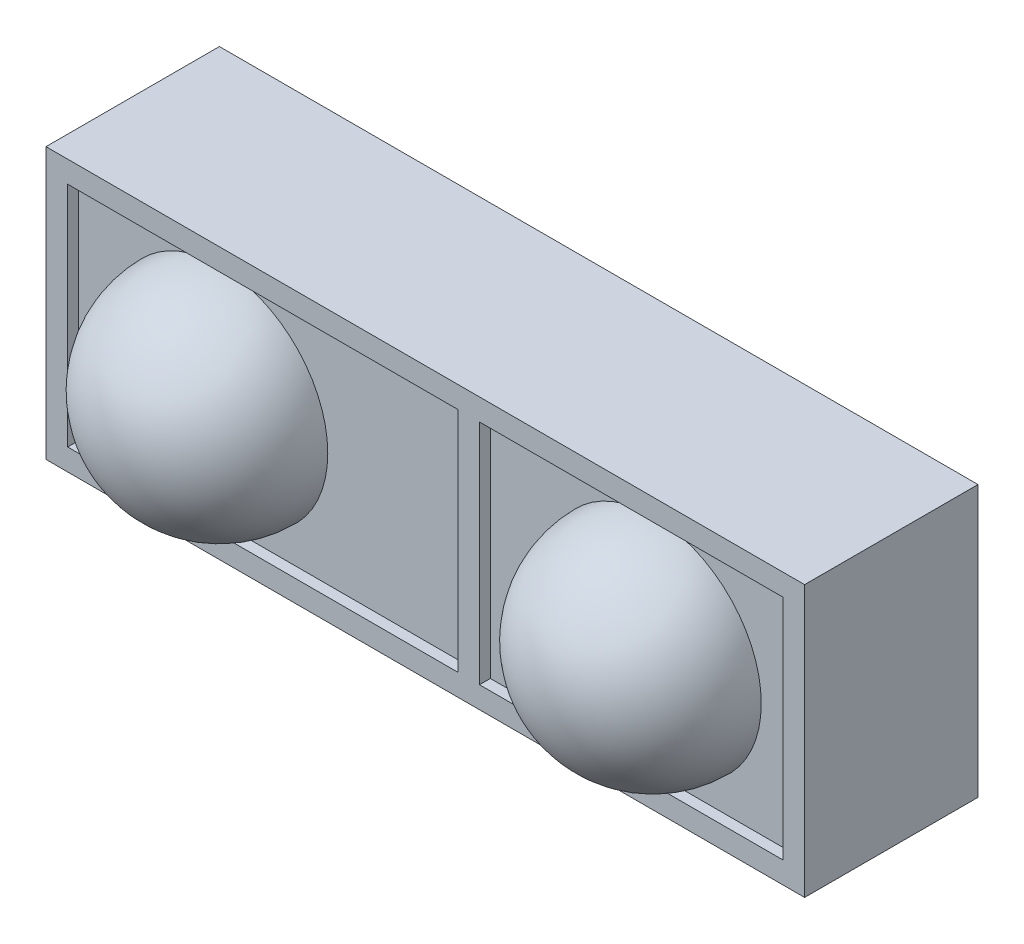
ISO-10303-21;
HEADER;
FILE_DESCRIPTION(('STEP AP214'),'2;1');
FILE_NAME('part.step','',(''),(''),'','','');
FILE_SCHEMA(('AUTOMOTIVE_DESIGN { 1 0 10303 214 1 1 1 1 }'));
ENDSEC;
DATA;
#1=APPLICATION_CONTEXT('core data for automotive mechanical design processes');
#2=APPLICATION_PROTOCOL_DEFINITION('international standard','automotive_design',2000,#1);
#3=PRODUCT_CONTEXT('',#1,'mechanical');
#4=PRODUCT('Part','Part','',(#3));
#5=PRODUCT_RELATED_PRODUCT_CATEGORY('part','',(#4));
#6=PRODUCT_DEFINITION_FORMATION('','',#4);
#7=PRODUCT_DEFINITION_CONTEXT('part definition',#1,'design');
#8=PRODUCT_DEFINITION('design','',#6,#7);
#9=PRODUCT_DEFINITION_SHAPE('','',#8);
#10=(LENGTH_UNIT() NAMED_UNIT(*) SI_UNIT(.MILLI.,.METRE.));
#11=(NAMED_UNIT(*) PLANE_ANGLE_UNIT() SI_UNIT($,.RADIAN.));
#12=(NAMED_UNIT(*) SI_UNIT($,.STERADIAN.) SOLID_ANGLE_UNIT());
#13=UNCERTAINTY_MEASURE_WITH_UNIT(LENGTH_MEASURE(1.E-05),#10,'distance_accuracy_value','');
#14=(GEOMETRIC_REPRESENTATION_CONTEXT(3) GLOBAL_UNCERTAINTY_ASSIGNED_CONTEXT((#13)) GLOBAL_UNIT_ASSIGNED_CONTEXT((#10,
#11,#12)) REPRESENTATION_CONTEXT('',''));
#15=CARTESIAN_POINT('',(0.,0.,0.));
#16=DIRECTION('',(0.,0.,1.));
#17=DIRECTION('',(1.,0.,0.));
#18=AXIS2_PLACEMENT_3D('',#15,#16,#17);
#19=CARTESIAN_POINT('',(-3.5,1.25,1.5));
#20=DIRECTION('',(1.,0.,0.));
#21=DIRECTION('',(0.,0.,-1.));
#22=AXIS2_PLACEMENT_3D('',#19,#20,#21);
#23=PLANE('',#22);
#24=DIRECTION('',(0.,-1.,0.));
#25=VECTOR('',#24,1.);
#26=CARTESIAN_POINT('',(-3.5,1.25,0.));
#27=LINE('',#26,#25);
#28=CARTESIAN_POINT('',(-3.5,1.25,0.));
#29=VERTEX_POINT('',#28);
#30=CARTESIAN_POINT('',(-3.5,-1.25,0.));
#31=VERTEX_POINT('',#30);
#32=EDGE_CURVE('E197',#29,#31,#27,.T.);
#33=ORIENTED_EDGE('',*,*,#32,.T.);
#34=DIRECTION('',(0.,0.,-1.));
#35=VECTOR('',#34,1.);
#36=CARTESIAN_POINT('',(-3.5,-1.25,1.5));
#37=LINE('',#36,#35);
#38=CARTESIAN_POINT('',(-3.5,-1.25,1.6));
#39=VERTEX_POINT('',#38);
#40=EDGE_CURVE('E215',#39,#31,#37,.T.);
#41=ORIENTED_EDGE('',*,*,#40,.F.);
#42=DIRECTION('',(0.,-1.,0.));
#43=VECTOR('',#42,1.);
#44=CARTESIAN_POINT('',(-3.5,1.25,1.6));
#45=LINE('',#44,#43);
#46=CARTESIAN_POINT('',(-3.5,1.25,1.6));
#47=VERTEX_POINT('',#46);
#48=EDGE_CURVE('E188',#47,#39,#45,.T.);
#49=ORIENTED_EDGE('',*,*,#48,.F.);
#50=DIRECTION('',(0.,0.,-1.));
#51=VECTOR('',#50,1.);
#52=CARTESIAN_POINT('',(-3.5,1.25,1.5));
#53=LINE('',#52,#51);
#54=EDGE_CURVE('E206',#47,#29,#53,.T.);
#55=ORIENTED_EDGE('',*,*,#54,.T.);
#56=EDGE_LOOP('',(#33,#41,#49,#55));
#57=FACE_BOUND('',#56,.T.);
#58=ADVANCED_FACE('F31',(#57),#23,.F.);
#59=CARTESIAN_POINT('',(-3.5,-1.25,1.5));
#60=DIRECTION('',(0.,1.,0.));
#61=DIRECTION('',(0.,0.,1.));
#62=AXIS2_PLACEMENT_3D('',#59,#60,#61);
#63=PLANE('',#62);
#64=DIRECTION('',(1.,0.,0.));
#65=VECTOR('',#64,1.);
#66=CARTESIAN_POINT('',(-3.5,-1.25,0.));
#67=LINE('',#66,#65);
#68=CARTESIAN_POINT('',(3.5,-1.25,0.));
#69=VERTEX_POINT('',#68);
#70=EDGE_CURVE('E200',#31,#69,#67,.T.);
#71=ORIENTED_EDGE('',*,*,#70,.T.);
#72=DIRECTION('',(0.,0.,-1.));
#73=VECTOR('',#72,1.);
#74=CARTESIAN_POINT('',(3.5,-1.25,1.5));
#75=LINE('',#74,#73);
#76=CARTESIAN_POINT('',(3.5,-1.25,1.6));
#77=VERTEX_POINT('',#76);
#78=EDGE_CURVE('E212',#77,#69,#75,.T.);
#79=ORIENTED_EDGE('',*,*,#78,.F.);
#80=DIRECTION('',(1.,0.,0.));
#81=VECTOR('',#80,1.);
#82=CARTESIAN_POINT('',(-3.5,-1.25,1.6));
#83=LINE('',#82,#81);
#84=EDGE_CURVE('E191',#39,#77,#83,.T.);
#85=ORIENTED_EDGE('',*,*,#84,.F.);
#86=ORIENTED_EDGE('',*,*,#40,.T.);
#87=EDGE_LOOP('',(#71,#79,#85,#86));
#88=FACE_BOUND('',#87,.T.);
#89=ADVANCED_FACE('F239',(#88),#63,.F.);
#90=CARTESIAN_POINT('',(3.5,1.25,1.5));
#91=DIRECTION('',(-1.,0.,0.));
#92=DIRECTION('',(0.,-1.,0.));
#93=AXIS2_PLACEMENT_3D('',#90,#91,#92);
#94=PLANE('',#93);
#95=DIRECTION('',(0.,1.,0.));
#96=VECTOR('',#95,1.);
#97=CARTESIAN_POINT('',(3.5,1.25,0.));
#98=LINE('',#97,#96);
#99=CARTESIAN_POINT('',(3.5,1.25,0.));
#100=VERTEX_POINT('',#99);
#101=EDGE_CURVE('E202',#69,#100,#98,.T.);
#102=ORIENTED_EDGE('',*,*,#101,.T.);
#103=DIRECTION('',(0.,0.,-1.));
#104=VECTOR('',#103,1.);
#105=CARTESIAN_POINT('',(3.5,1.25,1.5));
#106=LINE('',#105,#104);
#107=CARTESIAN_POINT('',(3.5,1.25,1.6));
#108=VERTEX_POINT('',#107);
#109=EDGE_CURVE('E209',#108,#100,#106,.T.);
#110=ORIENTED_EDGE('',*,*,#109,.F.);
#111=DIRECTION('',(0.,1.,0.));
#112=VECTOR('',#111,1.);
#113=CARTESIAN_POINT('',(3.5,-1.25,1.6));
#114=LINE('',#113,#112);
#115=EDGE_CURVE('E194',#77,#108,#114,.T.);
#116=ORIENTED_EDGE('',*,*,#115,.F.);
#117=ORIENTED_EDGE('',*,*,#78,.T.);
#118=EDGE_LOOP('',(#102,#110,#116,#117));
#119=FACE_BOUND('',#118,.T.);
#120=ADVANCED_FACE('F244',(#119),#94,.F.);
#121=CARTESIAN_POINT('',(-3.5,1.25,1.5));
#122=DIRECTION('',(0.,-1.,0.));
#123=DIRECTION('',(0.,0.,-1.));
#124=AXIS2_PLACEMENT_3D('',#121,#122,#123);
#125=PLANE('',#124);
#126=DIRECTION('',(-1.,0.,0.));
#127=VECTOR('',#126,1.);
#128=CARTESIAN_POINT('',(-3.5,1.25,0.));
#129=LINE('',#128,#127);
#130=EDGE_CURVE('E204',#100,#29,#129,.T.);
#131=ORIENTED_EDGE('',*,*,#130,.T.);
#132=ORIENTED_EDGE('',*,*,#54,.F.);
#133=DIRECTION('',(-1.,0.,0.));
#134=VECTOR('',#133,1.);
#135=CARTESIAN_POINT('',(3.5,1.25,1.6));
#136=LINE('',#135,#134);
#137=EDGE_CURVE('E185',#108,#47,#136,.T.);
#138=ORIENTED_EDGE('',*,*,#137,.F.);
#139=ORIENTED_EDGE('',*,*,#109,.T.);
#140=EDGE_LOOP('',(#131,#132,#138,#139));
#141=FACE_BOUND('',#140,.T.);
#142=ADVANCED_FACE('F258',(#141),#125,.F.);
#143=CARTESIAN_POINT('',(-3.5,-1.25,0.));
#144=DIRECTION('',(0.,0.,1.));
#145=DIRECTION('',(1.,0.,0.));
#146=AXIS2_PLACEMENT_3D('',#143,#144,#145);
#147=PLANE('',#146);
#148=ORIENTED_EDGE('',*,*,#32,.F.);
#149=ORIENTED_EDGE('',*,*,#130,.F.);
#150=ORIENTED_EDGE('',*,*,#101,.F.);
#151=ORIENTED_EDGE('',*,*,#70,.F.);
#152=EDGE_LOOP('',(#148,#149,#150,#151));
#153=FACE_BOUND('',#152,.T.);
#154=ADVANCED_FACE('F250',(#153),#147,.F.);
#155=CARTESIAN_POINT('',(-3.5,1.25,1.6));
#156=DIRECTION('',(0.,0.,1.));
#157=DIRECTION('',(1.,0.,0.));
#158=AXIS2_PLACEMENT_3D('',#155,#156,#157);
#159=PLANE('',#158);
#160=DIRECTION('',(1.,0.,0.));
#161=VECTOR('',#160,1.);
#162=CARTESIAN_POINT('',(-3.3,-1.05,1.6));
#163=LINE('',#162,#161);
#164=CARTESIAN_POINT('',(-3.3,-1.05,1.6));
#165=VERTEX_POINT('',#164);
#166=CARTESIAN_POINT('',(0.3,-1.05,1.6));
#167=VERTEX_POINT('',#166);
#168=EDGE_CURVE('E161',#165,#167,#163,.T.);
#169=ORIENTED_EDGE('',*,*,#168,.F.);
#170=DIRECTION('',(0.,-1.,0.));
#171=VECTOR('',#170,1.);
#172=CARTESIAN_POINT('',(-3.3,1.05,1.6));
#173=LINE('',#172,#171);
#174=CARTESIAN_POINT('',(-3.3,1.05,1.6));
#175=VERTEX_POINT('',#174);
#176=EDGE_CURVE('E159',#175,#165,#173,.T.);
#177=ORIENTED_EDGE('',*,*,#176,.F.);
#178=DIRECTION('',(-1.,0.,0.));
#179=VECTOR('',#178,1.);
#180=CARTESIAN_POINT('',(0.3,1.05,1.6));
#181=LINE('',#180,#179);
#182=CARTESIAN_POINT('',(0.3,1.05,1.6));
#183=VERTEX_POINT('',#182);
#184=EDGE_CURVE('E167',#183,#175,#181,.T.);
#185=ORIENTED_EDGE('',*,*,#184,.F.);
#186=DIRECTION('',(0.,1.,0.));
#187=VECTOR('',#186,1.);
#188=CARTESIAN_POINT('',(0.3,-1.05,1.6));
#189=LINE('',#188,#187);
#190=EDGE_CURVE('E164',#167,#183,#189,.T.);
#191=ORIENTED_EDGE('',*,*,#190,.F.);
#192=EDGE_LOOP('',(#169,#177,#185,#191));
#193=FACE_BOUND('',#192,.T.);
#194=ORIENTED_EDGE('',*,*,#137,.T.);
#195=ORIENTED_EDGE('',*,*,#48,.T.);
#196=ORIENTED_EDGE('',*,*,#84,.T.);
#197=ORIENTED_EDGE('',*,*,#115,.T.);
#198=EDGE_LOOP('',(#194,#195,#196,#197));
#199=FACE_BOUND('',#198,.T.);
#200=DIRECTION('',(-1.,0.,0.));
#201=VECTOR('',#200,1.);
#202=CARTESIAN_POINT('',(3.3,1.05,1.6));
#203=LINE('',#202,#201);
#204=CARTESIAN_POINT('',(3.3,1.05,1.6));
#205=VERTEX_POINT('',#204);
#206=CARTESIAN_POINT('',(0.5,1.05,1.6));
#207=VERTEX_POINT('',#206);
#208=EDGE_CURVE('E128',#205,#207,#203,.T.);
#209=ORIENTED_EDGE('',*,*,#208,.F.);
#210=DIRECTION('',(0.,1.,0.));
#211=VECTOR('',#210,1.);
#212=CARTESIAN_POINT('',(3.3,-1.05,1.6));
#213=LINE('',#212,#211);
#214=CARTESIAN_POINT('',(3.3,-1.05,1.6));
#215=VERTEX_POINT('',#214);
#216=EDGE_CURVE('E118',#215,#205,#213,.T.);
#217=ORIENTED_EDGE('',*,*,#216,.F.);
#218=DIRECTION('',(1.,0.,0.));
#219=VECTOR('',#218,1.);
#220=CARTESIAN_POINT('',(0.5,-1.05,1.6));
#221=LINE('',#220,#219);
#222=CARTESIAN_POINT('',(0.5,-1.05,1.6));
#223=VERTEX_POINT('',#222);
#224=EDGE_CURVE('E144',#223,#215,#221,.T.);
#225=ORIENTED_EDGE('',*,*,#224,.F.);
#226=DIRECTION('',(0.,-1.,0.));
#227=VECTOR('',#226,1.);
#228=CARTESIAN_POINT('',(0.5,-1.05,1.6));
#229=LINE('',#228,#227);
#230=EDGE_CURVE('E142',#207,#223,#229,.T.);
#231=ORIENTED_EDGE('',*,*,#230,.F.);
#232=EDGE_LOOP('',(#209,#217,#225,#231));
#233=FACE_BOUND('',#232,.T.);
#234=ADVANCED_FACE('F140',(#193,#199,#233),#159,.T.);
#235=CARTESIAN_POINT('',(-3.3,1.05,1.6));
#236=DIRECTION('',(1.,0.,0.));
#237=DIRECTION('',(0.,0.,-1.));
#238=AXIS2_PLACEMENT_3D('',#235,#236,#237);
#239=PLANE('',#238);
#240=DIRECTION('',(0.,-1.,0.));
#241=VECTOR('',#240,1.);
#242=CARTESIAN_POINT('',(-3.3,1.05,1.5));
#243=LINE('',#242,#241);
#244=CARTESIAN_POINT('',(-3.3,1.05,1.5));
#245=VERTEX_POINT('',#244);
#246=CARTESIAN_POINT('',(-3.3,-1.05,1.5));
#247=VERTEX_POINT('',#246);
#248=EDGE_CURVE('E45',#245,#247,#243,.T.);
#249=ORIENTED_EDGE('',*,*,#248,.F.);
#250=DIRECTION('',(0.,0.,-1.));
#251=VECTOR('',#250,1.);
#252=CARTESIAN_POINT('',(-3.3,1.05,1.6));
#253=LINE('',#252,#251);
#254=EDGE_CURVE('E169',#175,#245,#253,.T.);
#255=ORIENTED_EDGE('',*,*,#254,.F.);
#256=ORIENTED_EDGE('',*,*,#176,.T.);
#257=DIRECTION('',(0.,0.,-1.));
#258=VECTOR('',#257,1.);
#259=CARTESIAN_POINT('',(-3.3,-1.05,1.6));
#260=LINE('',#259,#258);
#261=EDGE_CURVE('E182',#165,#247,#260,.T.);
#262=ORIENTED_EDGE('',*,*,#261,.T.);
#263=EDGE_LOOP('',(#249,#255,#256,#262));
#264=FACE_BOUND('',#263,.T.);
#265=ADVANCED_FACE('F307',(#264),#239,.T.);
#266=CARTESIAN_POINT('',(-3.3,-1.05,1.6));
#267=DIRECTION('',(0.,1.,0.));
#268=DIRECTION('',(-1.,0.,0.));
#269=AXIS2_PLACEMENT_3D('',#266,#267,#268);
#270=PLANE('',#269);
#271=DIRECTION('',(1.,0.,0.));
#272=VECTOR('',#271,1.);
#273=CARTESIAN_POINT('',(-3.3,-1.05,1.5));
#274=LINE('',#273,#272);
#275=CARTESIAN_POINT('',(0.3,-1.05,1.5));
#276=VERTEX_POINT('',#275);
#277=EDGE_CURVE('E49',#247,#276,#274,.T.);
#278=ORIENTED_EDGE('',*,*,#277,.F.);
#279=ORIENTED_EDGE('',*,*,#261,.F.);
#280=ORIENTED_EDGE('',*,*,#168,.T.);
#281=DIRECTION('',(0.,0.,-1.));
#282=VECTOR('',#281,1.);
#283=CARTESIAN_POINT('',(0.3,-1.05,1.6));
#284=LINE('',#283,#282);
#285=EDGE_CURVE('E180',#167,#276,#284,.T.);
#286=ORIENTED_EDGE('',*,*,#285,.T.);
#287=EDGE_LOOP('',(#278,#279,#280,#286));
#288=FACE_BOUND('',#287,.T.);
#289=ADVANCED_FACE('F315',(#288),#270,.T.);
#290=CARTESIAN_POINT('',(0.3,-1.05,1.6));
#291=DIRECTION('',(-1.,0.,0.));
#292=DIRECTION('',(0.,0.,1.));
#293=AXIS2_PLACEMENT_3D('',#290,#291,#292);
#294=PLANE('',#293);
#295=DIRECTION('',(0.,1.,0.));
#296=VECTOR('',#295,1.);
#297=CARTESIAN_POINT('',(0.3,-1.05,1.5));
#298=LINE('',#297,#296);
#299=CARTESIAN_POINT('',(0.3,1.05,1.5));
#300=VERTEX_POINT('',#299);
#301=EDGE_CURVE('E172',#276,#300,#298,.T.);
#302=ORIENTED_EDGE('',*,*,#301,.F.);
#303=ORIENTED_EDGE('',*,*,#285,.F.);
#304=ORIENTED_EDGE('',*,*,#190,.T.);
#305=DIRECTION('',(0.,0.,-1.));
#306=VECTOR('',#305,1.);
#307=CARTESIAN_POINT('',(0.3,1.05,1.6));
#308=LINE('',#307,#306);
#309=EDGE_CURVE('E177',#183,#300,#308,.T.);
#310=ORIENTED_EDGE('',*,*,#309,.T.);
#311=EDGE_LOOP('',(#302,#303,#304,#310));
#312=FACE_BOUND('',#311,.T.);
#313=ADVANCED_FACE('F323',(#312),#294,.T.);
#314=CARTESIAN_POINT('',(0.3,1.05,1.6));
#315=DIRECTION('',(0.,-1.,0.));
#316=DIRECTION('',(1.,0.,0.));
#317=AXIS2_PLACEMENT_3D('',#314,#315,#316);
#318=PLANE('',#317);
#319=DIRECTION('',(-1.,0.,0.));
#320=VECTOR('',#319,1.);
#321=CARTESIAN_POINT('',(0.3,1.05,1.5));
#322=LINE('',#321,#320);
#323=EDGE_CURVE('E162',#300,#245,#322,.T.);
#324=ORIENTED_EDGE('',*,*,#323,.F.);
#325=ORIENTED_EDGE('',*,*,#309,.F.);
#326=ORIENTED_EDGE('',*,*,#184,.T.);
#327=ORIENTED_EDGE('',*,*,#254,.T.);
#328=EDGE_LOOP('',(#324,#325,#326,#327));
#329=FACE_BOUND('',#328,.T.);
#330=ADVANCED_FACE('F331',(#329),#318,.T.);
#331=CARTESIAN_POINT('',(3.3,-1.05,1.6));
#332=DIRECTION('',(-1.,0.,0.));
#333=DIRECTION('',(0.,-1.,0.));
#334=AXIS2_PLACEMENT_3D('',#331,#332,#333);
#335=PLANE('',#334);
#336=DIRECTION('',(0.,1.,0.));
#337=VECTOR('',#336,1.);
#338=CARTESIAN_POINT('',(3.3,-1.05,1.5));
#339=LINE('',#338,#337);
#340=CARTESIAN_POINT('',(3.3,-1.05,1.5));
#341=VERTEX_POINT('',#340);
#342=CARTESIAN_POINT('',(3.3,1.05,1.5));
#343=VERTEX_POINT('',#342);
#344=EDGE_CURVE('E148',#341,#343,#339,.T.);
#345=ORIENTED_EDGE('',*,*,#344,.F.);
#346=DIRECTION('',(0.,0.,-1.));
#347=VECTOR('',#346,1.);
#348=CARTESIAN_POINT('',(3.3,-1.05,1.6));
#349=LINE('',#348,#347);
#350=EDGE_CURVE('E124',#215,#341,#349,.T.);
#351=ORIENTED_EDGE('',*,*,#350,.F.);
#352=ORIENTED_EDGE('',*,*,#216,.T.);
#353=DIRECTION('',(0.,0.,-1.));
#354=VECTOR('',#353,1.);
#355=CARTESIAN_POINT('',(3.3,1.05,1.6));
#356=LINE('',#355,#354);
#357=EDGE_CURVE('E122',#205,#343,#356,.T.);
#358=ORIENTED_EDGE('',*,*,#357,.T.);
#359=EDGE_LOOP('',(#345,#351,#352,#358));
#360=FACE_BOUND('',#359,.T.);
#361=ADVANCED_FACE('F121',(#360),#335,.T.);
#362=CARTESIAN_POINT('',(3.3,1.05,1.6));
#363=DIRECTION('',(0.,-1.,0.));
#364=DIRECTION('',(1.,0.,0.));
#365=AXIS2_PLACEMENT_3D('',#362,#363,#364);
#366=PLANE('',#365);
#367=DIRECTION('',(-1.,0.,0.));
#368=VECTOR('',#367,1.);
#369=CARTESIAN_POINT('',(3.3,1.05,1.5));
#370=LINE('',#369,#368);
#371=CARTESIAN_POINT('',(0.5,1.05,1.5));
#372=VERTEX_POINT('',#371);
#373=EDGE_CURVE('E136',#343,#372,#370,.T.);
#374=ORIENTED_EDGE('',*,*,#373,.F.);
#375=ORIENTED_EDGE('',*,*,#357,.F.);
#376=ORIENTED_EDGE('',*,*,#208,.T.);
#377=DIRECTION('',(0.,0.,-1.));
#378=VECTOR('',#377,1.);
#379=CARTESIAN_POINT('',(0.5,1.05,1.6));
#380=LINE('',#379,#378);
#381=EDGE_CURVE('E137',#207,#372,#380,.T.);
#382=ORIENTED_EDGE('',*,*,#381,.T.);
#383=EDGE_LOOP('',(#374,#375,#376,#382));
#384=FACE_BOUND('',#383,.T.);
#385=ADVANCED_FACE('F133',(#384),#366,.T.);
#386=CARTESIAN_POINT('',(0.5,-1.05,1.6));
#387=DIRECTION('',(1.,0.,0.));
#388=DIRECTION('',(0.,0.,-1.));
#389=AXIS2_PLACEMENT_3D('',#386,#387,#388);
#390=PLANE('',#389);
#391=DIRECTION('',(0.,-1.,0.));
#392=VECTOR('',#391,1.);
#393=CARTESIAN_POINT('',(0.5,-1.05,1.5));
#394=LINE('',#393,#392);
#395=CARTESIAN_POINT('',(0.5,-1.05,1.5));
#396=VERTEX_POINT('',#395);
#397=EDGE_CURVE('E151',#372,#396,#394,.T.);
#398=ORIENTED_EDGE('',*,*,#397,.F.);
#399=ORIENTED_EDGE('',*,*,#381,.F.);
#400=ORIENTED_EDGE('',*,*,#230,.T.);
#401=DIRECTION('',(0.,0.,-1.));
#402=VECTOR('',#401,1.);
#403=CARTESIAN_POINT('',(0.5,-1.05,1.6));
#404=LINE('',#403,#402);
#405=EDGE_CURVE('E155',#223,#396,#404,.T.);
#406=ORIENTED_EDGE('',*,*,#405,.T.);
#407=EDGE_LOOP('',(#398,#399,#400,#406));
#408=FACE_BOUND('',#407,.T.);
#409=ADVANCED_FACE('F352',(#408),#390,.T.);
#410=CARTESIAN_POINT('',(0.5,-1.05,1.6));
#411=DIRECTION('',(0.,1.,0.));
#412=DIRECTION('',(-1.,0.,0.));
#413=AXIS2_PLACEMENT_3D('',#410,#411,#412);
#414=PLANE('',#413);
#415=DIRECTION('',(1.,0.,0.));
#416=VECTOR('',#415,1.);
#417=CARTESIAN_POINT('',(0.5,-1.05,1.5));
#418=LINE('',#417,#416);
#419=EDGE_CURVE('E129',#396,#341,#418,.T.);
#420=ORIENTED_EDGE('',*,*,#419,.F.);
#421=ORIENTED_EDGE('',*,*,#405,.F.);
#422=ORIENTED_EDGE('',*,*,#224,.T.);
#423=ORIENTED_EDGE('',*,*,#350,.T.);
#424=EDGE_LOOP('',(#420,#421,#422,#423));
#425=FACE_BOUND('',#424,.T.);
#426=ADVANCED_FACE('F234',(#425),#414,.T.);
#427=CARTESIAN_POINT('',(2.,0.,1.5));
#428=DIRECTION('',(0.,0.,1.));
#429=DIRECTION('',(-1.,0.,0.));
#430=AXIS2_PLACEMENT_3D('',#427,#428,#429);
#431=SPHERICAL_SURFACE('',#430,1.);
#432=CARTESIAN_POINT('',(2.,0.,1.5));
#433=DIRECTION('',(0.,0.,1.));
#434=DIRECTION('',(1.,0.,0.));
#435=AXIS2_PLACEMENT_3D('',#432,#433,#434);
#436=CIRCLE('',#435,1.);
#437=CARTESIAN_POINT('',(3.,0.,1.5));
#438=VERTEX_POINT('',#437);
#439=EDGE_CURVE('E38',#438,#438,#436,.T.);
#440=ORIENTED_EDGE('',*,*,#439,.T.);
#441=EDGE_LOOP('',(#440));
#442=FACE_BOUND('',#441,.T.);
#443=ADVANCED_FACE('F220',(#442),#431,.T.);
#444=CARTESIAN_POINT('',(-3.5,-1.25,1.5));
#445=DIRECTION('',(0.,0.,1.));
#446=DIRECTION('',(1.,0.,0.));
#447=AXIS2_PLACEMENT_3D('',#444,#445,#446);
#448=PLANE('',#447);
#449=ORIENTED_EDGE('',*,*,#344,.T.);
#450=ORIENTED_EDGE('',*,*,#373,.T.);
#451=ORIENTED_EDGE('',*,*,#397,.T.);
#452=ORIENTED_EDGE('',*,*,#419,.T.);
#453=EDGE_LOOP('',(#449,#450,#451,#452));
#454=FACE_BOUND('',#453,.T.);
#455=ORIENTED_EDGE('',*,*,#439,.F.);
#456=EDGE_LOOP('',(#455));
#457=FACE_BOUND('',#456,.T.);
#458=ADVANCED_FACE('F222',(#454,#457),#448,.T.);
#459=CARTESIAN_POINT('',(-2.,0.,1.5));
#460=DIRECTION('',(0.,0.,1.));
#461=DIRECTION('',(-1.,0.,0.));
#462=AXIS2_PLACEMENT_3D('',#459,#460,#461);
#463=SPHERICAL_SURFACE('',#462,1.);
#464=CARTESIAN_POINT('',(-2.,0.,1.5));
#465=DIRECTION('',(0.,0.,1.));
#466=DIRECTION('',(1.,0.,0.));
#467=AXIS2_PLACEMENT_3D('',#464,#465,#466);
#468=CIRCLE('',#467,1.);
#469=CARTESIAN_POINT('',(-1.,0.,1.5));
#470=VERTEX_POINT('',#469);
#471=EDGE_CURVE('E11',#470,#470,#468,.T.);
#472=ORIENTED_EDGE('',*,*,#471,.T.);
#473=EDGE_LOOP('',(#472));
#474=FACE_BOUND('',#473,.T.);
#475=ADVANCED_FACE('F224',(#474),#463,.T.);
#476=ORIENTED_EDGE('',*,*,#248,.T.);
#477=ORIENTED_EDGE('',*,*,#277,.T.);
#478=ORIENTED_EDGE('',*,*,#301,.T.);
#479=ORIENTED_EDGE('',*,*,#323,.T.);
#480=EDGE_LOOP('',(#476,#477,#478,#479));
#481=FACE_BOUND('',#480,.T.);
#482=ORIENTED_EDGE('',*,*,#471,.F.);
#483=EDGE_LOOP('',(#482));
#484=FACE_BOUND('',#483,.T.);
#485=ADVANCED_FACE('F227',(#481,#484),#448,.T.);
#486=CLOSED_SHELL('',(#58,#89,#120,#142,#154,#234,#265,#289,#313,#330,#361,#385,#409,#426,#443,
#458,#475,#485));
#487=MANIFOLD_SOLID_BREP('B2',#486);
#488=ADVANCED_BREP_SHAPE_REPRESENTATION('',(#18,#487),#14);
#489=SHAPE_DEFINITION_REPRESENTATION(#9,#488);
ENDSEC;
END-ISO-10303-21;
